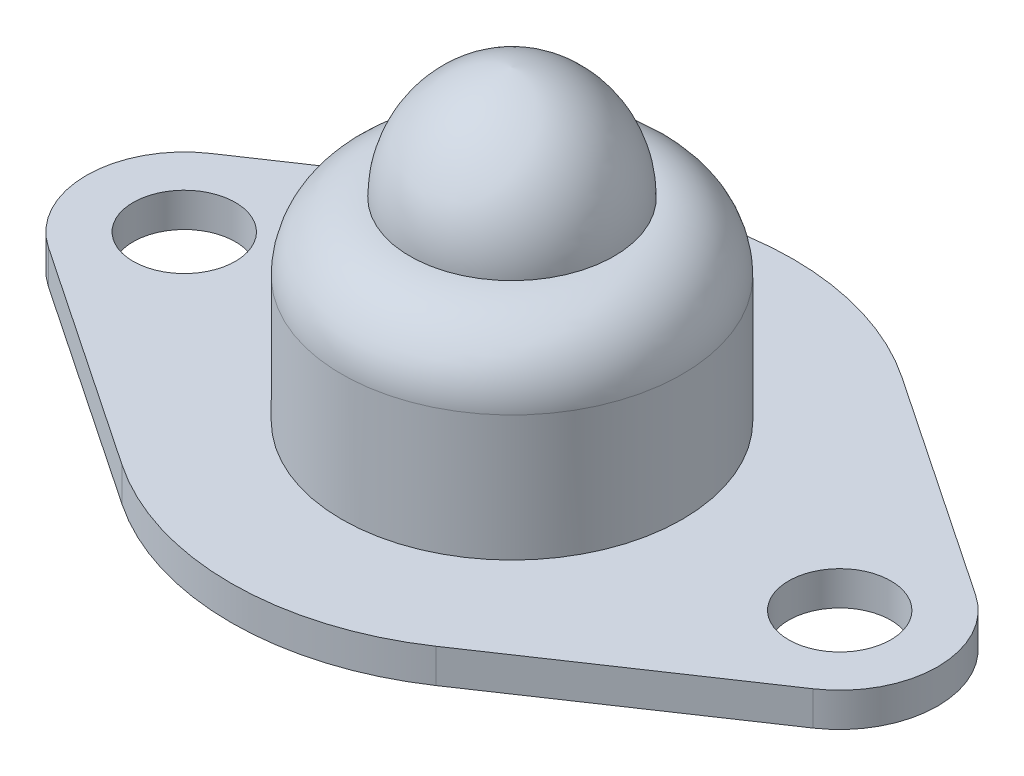
ISO-10303-21;
HEADER;
FILE_DESCRIPTION(('STEP AP214'),'2;1');
FILE_NAME('part.step','',(''),(''),'','','');
FILE_SCHEMA(('AUTOMOTIVE_DESIGN { 1 0 10303 214 1 1 1 1 }'));
ENDSEC;
DATA;
#1=APPLICATION_CONTEXT('core data for automotive mechanical design processes');
#2=APPLICATION_PROTOCOL_DEFINITION('international standard','automotive_design',2000,#1);
#3=PRODUCT_CONTEXT('',#1,'mechanical');
#4=PRODUCT('Part','Part','',(#3));
#5=PRODUCT_RELATED_PRODUCT_CATEGORY('part','',(#4));
#6=PRODUCT_DEFINITION_FORMATION('','',#4);
#7=PRODUCT_DEFINITION_CONTEXT('part definition',#1,'design');
#8=PRODUCT_DEFINITION('design','',#6,#7);
#9=PRODUCT_DEFINITION_SHAPE('','',#8);
#10=(LENGTH_UNIT() NAMED_UNIT(*) SI_UNIT(.MILLI.,.METRE.));
#11=(NAMED_UNIT(*) PLANE_ANGLE_UNIT() SI_UNIT($,.RADIAN.));
#12=(NAMED_UNIT(*) SI_UNIT($,.STERADIAN.) SOLID_ANGLE_UNIT());
#13=UNCERTAINTY_MEASURE_WITH_UNIT(LENGTH_MEASURE(1.E-05),#10,'distance_accuracy_value','');
#14=(GEOMETRIC_REPRESENTATION_CONTEXT(3) GLOBAL_UNCERTAINTY_ASSIGNED_CONTEXT((#13)) GLOBAL_UNIT_ASSIGNED_CONTEXT((#10,
#11,#12)) REPRESENTATION_CONTEXT('',''));
#15=CARTESIAN_POINT('',(0.,0.,0.));
#16=DIRECTION('',(0.,0.,1.));
#17=DIRECTION('',(1.,0.,0.));
#18=AXIS2_PLACEMENT_3D('',#15,#16,#17);
#19=CARTESIAN_POINT('',(0.,1.,0.));
#20=DIRECTION('',(0.,1.,0.));
#21=DIRECTION('',(0.,0.,1.));
#22=AXIS2_PLACEMENT_3D('',#19,#20,#21);
#23=PLANE('',#22);
#24=CARTESIAN_POINT('',(0.,1.,0.));
#25=DIRECTION('',(0.,1.,0.));
#26=DIRECTION('',(0.,0.,1.));
#27=AXIS2_PLACEMENT_3D('',#24,#25,#26);
#28=CIRCLE('',#27,5.);
#29=CARTESIAN_POINT('',(0.,1.,5.));
#30=VERTEX_POINT('',#29);
#31=EDGE_CURVE('E11',#30,#30,#28,.T.);
#32=ORIENTED_EDGE('',*,*,#31,.F.);
#33=EDGE_LOOP('',(#32));
#34=FACE_BOUND('',#33,.T.);
#35=CARTESIAN_POINT('',(-9.625,1.,0.));
#36=DIRECTION('',(0.,1.,0.));
#37=DIRECTION('',(0.,0.,1.));
#38=AXIS2_PLACEMENT_3D('',#35,#36,#37);
#39=CIRCLE('',#38,1.5);
#40=CARTESIAN_POINT('',(-9.625,1.,1.5));
#41=VERTEX_POINT('',#40);
#42=EDGE_CURVE('E138',#41,#41,#39,.T.);
#43=ORIENTED_EDGE('',*,*,#42,.F.);
#44=EDGE_LOOP('',(#43));
#45=FACE_BOUND('',#44,.T.);
#46=CARTESIAN_POINT('',(0.,1.,0.));
#47=DIRECTION('',(0.,1.,0.));
#48=DIRECTION('',(0.,0.,1.));
#49=AXIS2_PLACEMENT_3D('',#46,#47,#48);
#50=CIRCLE('',#49,8.25);
#51=CARTESIAN_POINT('',(4.60714285714285,1.,-6.84373689543056));
#52=VERTEX_POINT('',#51);
#53=CARTESIAN_POINT('',(-4.60714285714285,1.,-6.84373689543056));
#54=VERTEX_POINT('',#53);
#55=EDGE_CURVE('E149',#52,#54,#50,.T.);
#56=ORIENTED_EDGE('',*,*,#55,.T.);
#57=DIRECTION('',(-0.829543866112796,0.,0.558441558441558));
#58=VECTOR('',#57,1.);
#59=CARTESIAN_POINT('',(-4.60714285714285,1.,-6.84373689543056));
#60=LINE('',#59,#58);
#61=CARTESIAN_POINT('',(-11.2305194805195,1.,-2.38493861507429));
#62=VERTEX_POINT('',#61);
#63=EDGE_CURVE('E96',#54,#62,#60,.T.);
#64=ORIENTED_EDGE('',*,*,#63,.T.);
#65=CARTESIAN_POINT('',(-9.625,1.,0.));
#66=DIRECTION('',(0.,1.,0.));
#67=DIRECTION('',(0.,0.,1.));
#68=AXIS2_PLACEMENT_3D('',#65,#66,#67);
#69=CIRCLE('',#68,2.87500000000001);
#70=CARTESIAN_POINT('',(-11.2305194805195,1.,2.38493861507429));
#71=VERTEX_POINT('',#70);
#72=EDGE_CURVE('E181',#62,#71,#69,.T.);
#73=ORIENTED_EDGE('',*,*,#72,.T.);
#74=DIRECTION('',(0.829543866112796,0.,0.558441558441558));
#75=VECTOR('',#74,1.);
#76=CARTESIAN_POINT('',(-11.2305194805195,1.,2.38493861507429));
#77=LINE('',#76,#75);
#78=CARTESIAN_POINT('',(-4.60714285714285,1.,6.84373689543056));
#79=VERTEX_POINT('',#78);
#80=EDGE_CURVE('E180',#71,#79,#77,.T.);
#81=ORIENTED_EDGE('',*,*,#80,.T.);
#82=CARTESIAN_POINT('',(0.,1.,0.));
#83=DIRECTION('',(0.,1.,0.));
#84=DIRECTION('',(0.,0.,1.));
#85=AXIS2_PLACEMENT_3D('',#82,#83,#84);
#86=CIRCLE('',#85,8.25);
#87=CARTESIAN_POINT('',(4.60714285714285,1.,6.84373689543057));
#88=VERTEX_POINT('',#87);
#89=EDGE_CURVE('E116',#79,#88,#86,.T.);
#90=ORIENTED_EDGE('',*,*,#89,.T.);
#91=DIRECTION('',(0.829543866112796,0.,-0.558441558441558));
#92=VECTOR('',#91,1.);
#93=CARTESIAN_POINT('',(4.60714285714285,1.,6.84373689543056));
#94=LINE('',#93,#92);
#95=CARTESIAN_POINT('',(11.2305194805195,1.,2.38493861507429));
#96=VERTEX_POINT('',#95);
#97=EDGE_CURVE('E110',#88,#96,#94,.T.);
#98=ORIENTED_EDGE('',*,*,#97,.T.);
#99=CARTESIAN_POINT('',(9.625,1.,0.));
#100=DIRECTION('',(0.,1.,0.));
#101=DIRECTION('',(0.,0.,-1.));
#102=AXIS2_PLACEMENT_3D('',#99,#100,#101);
#103=CIRCLE('',#102,2.87500000000001);
#104=CARTESIAN_POINT('',(11.2305194805195,1.,-2.38493861507429));
#105=VERTEX_POINT('',#104);
#106=EDGE_CURVE('E114',#96,#105,#103,.T.);
#107=ORIENTED_EDGE('',*,*,#106,.T.);
#108=DIRECTION('',(-0.829543866112796,0.,-0.558441558441558));
#109=VECTOR('',#108,1.);
#110=CARTESIAN_POINT('',(11.2305194805195,1.,-2.38493861507429));
#111=LINE('',#110,#109);
#112=EDGE_CURVE('E51',#105,#52,#111,.T.);
#113=ORIENTED_EDGE('',*,*,#112,.T.);
#114=EDGE_LOOP('',(#56,#64,#73,#81,#90,#98,#107,#113));
#115=FACE_BOUND('',#114,.T.);
#116=CARTESIAN_POINT('',(9.625,1.,0.));
#117=DIRECTION('',(0.,1.,0.));
#118=DIRECTION('',(0.,0.,1.));
#119=AXIS2_PLACEMENT_3D('',#116,#117,#118);
#120=CIRCLE('',#119,1.5);
#121=CARTESIAN_POINT('',(9.625,1.,1.5));
#122=VERTEX_POINT('',#121);
#123=EDGE_CURVE('E190',#122,#122,#120,.T.);
#124=ORIENTED_EDGE('',*,*,#123,.F.);
#125=EDGE_LOOP('',(#124));
#126=FACE_BOUND('',#125,.T.);
#127=ADVANCED_FACE('F34',(#34,#45,#115,#126),#23,.T.);
#128=CARTESIAN_POINT('',(0.,0.,0.));
#129=DIRECTION('',(0.,1.,0.));
#130=DIRECTION('',(0.,0.,1.));
#131=AXIS2_PLACEMENT_3D('',#128,#129,#130);
#132=PLANE('',#131);
#133=CARTESIAN_POINT('',(0.,0.,0.));
#134=DIRECTION('',(0.,1.,0.));
#135=DIRECTION('',(0.,0.,1.));
#136=AXIS2_PLACEMENT_3D('',#133,#134,#135);
#137=CIRCLE('',#136,8.25);
#138=CARTESIAN_POINT('',(4.60714285714285,0.,-6.84373689543056));
#139=VERTEX_POINT('',#138);
#140=CARTESIAN_POINT('',(-4.60714285714285,0.,-6.84373689543056));
#141=VERTEX_POINT('',#140);
#142=EDGE_CURVE('E134',#139,#141,#137,.T.);
#143=ORIENTED_EDGE('',*,*,#142,.F.);
#144=DIRECTION('',(-0.829543866112796,0.,-0.558441558441558));
#145=VECTOR('',#144,1.);
#146=CARTESIAN_POINT('',(11.2305194805195,0.,-2.38493861507429));
#147=LINE('',#146,#145);
#148=CARTESIAN_POINT('',(11.2305194805195,0.,-2.38493861507429));
#149=VERTEX_POINT('',#148);
#150=EDGE_CURVE('E87',#149,#139,#147,.T.);
#151=ORIENTED_EDGE('',*,*,#150,.F.);
#152=CARTESIAN_POINT('',(9.625,0.,0.));
#153=DIRECTION('',(0.,1.,0.));
#154=DIRECTION('',(0.,0.,-1.));
#155=AXIS2_PLACEMENT_3D('',#152,#153,#154);
#156=CIRCLE('',#155,2.87500000000001);
#157=CARTESIAN_POINT('',(11.2305194805195,0.,2.38493861507429));
#158=VERTEX_POINT('',#157);
#159=EDGE_CURVE('E81',#158,#149,#156,.T.);
#160=ORIENTED_EDGE('',*,*,#159,.F.);
#161=DIRECTION('',(0.829543866112796,0.,-0.558441558441558));
#162=VECTOR('',#161,1.);
#163=CARTESIAN_POINT('',(4.60714285714285,0.,6.84373689543056));
#164=LINE('',#163,#162);
#165=CARTESIAN_POINT('',(4.60714285714285,0.,6.84373689543057));
#166=VERTEX_POINT('',#165);
#167=EDGE_CURVE('E124',#166,#158,#164,.T.);
#168=ORIENTED_EDGE('',*,*,#167,.F.);
#169=CARTESIAN_POINT('',(0.,0.,0.));
#170=DIRECTION('',(0.,1.,0.));
#171=DIRECTION('',(0.,0.,1.));
#172=AXIS2_PLACEMENT_3D('',#169,#170,#171);
#173=CIRCLE('',#172,8.25);
#174=CARTESIAN_POINT('',(-4.60714285714285,0.,6.84373689543056));
#175=VERTEX_POINT('',#174);
#176=EDGE_CURVE('E144',#175,#166,#173,.T.);
#177=ORIENTED_EDGE('',*,*,#176,.F.);
#178=DIRECTION('',(0.829543866112796,0.,0.558441558441558));
#179=VECTOR('',#178,1.);
#180=CARTESIAN_POINT('',(-11.2305194805195,0.,2.38493861507429));
#181=LINE('',#180,#179);
#182=CARTESIAN_POINT('',(-11.2305194805195,0.,2.38493861507429));
#183=VERTEX_POINT('',#182);
#184=EDGE_CURVE('E142',#183,#175,#181,.T.);
#185=ORIENTED_EDGE('',*,*,#184,.F.);
#186=CARTESIAN_POINT('',(-9.625,0.,0.));
#187=DIRECTION('',(0.,1.,0.));
#188=DIRECTION('',(0.,0.,1.));
#189=AXIS2_PLACEMENT_3D('',#186,#187,#188);
#190=CIRCLE('',#189,2.87500000000001);
#191=CARTESIAN_POINT('',(-11.2305194805195,0.,-2.38493861507429));
#192=VERTEX_POINT('',#191);
#193=EDGE_CURVE('E140',#192,#183,#190,.T.);
#194=ORIENTED_EDGE('',*,*,#193,.F.);
#195=DIRECTION('',(-0.829543866112796,0.,0.558441558441558));
#196=VECTOR('',#195,1.);
#197=CARTESIAN_POINT('',(-4.60714285714285,0.,-6.84373689543056));
#198=LINE('',#197,#196);
#199=EDGE_CURVE('E137',#141,#192,#198,.T.);
#200=ORIENTED_EDGE('',*,*,#199,.F.);
#201=EDGE_LOOP('',(#143,#151,#160,#168,#177,#185,#194,#200));
#202=FACE_BOUND('',#201,.T.);
#203=CARTESIAN_POINT('',(-9.625,0.,0.));
#204=DIRECTION('',(0.,1.,0.));
#205=DIRECTION('',(0.,0.,1.));
#206=AXIS2_PLACEMENT_3D('',#203,#204,#205);
#207=CIRCLE('',#206,1.5);
#208=CARTESIAN_POINT('',(-9.625,0.,1.5));
#209=VERTEX_POINT('',#208);
#210=EDGE_CURVE('E187',#209,#209,#207,.T.);
#211=ORIENTED_EDGE('',*,*,#210,.T.);
#212=EDGE_LOOP('',(#211));
#213=FACE_BOUND('',#212,.T.);
#214=CARTESIAN_POINT('',(9.625,0.,0.));
#215=DIRECTION('',(0.,1.,0.));
#216=DIRECTION('',(0.,0.,1.));
#217=AXIS2_PLACEMENT_3D('',#214,#215,#216);
#218=CIRCLE('',#217,1.5);
#219=CARTESIAN_POINT('',(9.625,0.,1.5));
#220=VERTEX_POINT('',#219);
#221=EDGE_CURVE('E193',#220,#220,#218,.T.);
#222=ORIENTED_EDGE('',*,*,#221,.T.);
#223=EDGE_LOOP('',(#222));
#224=FACE_BOUND('',#223,.T.);
#225=ADVANCED_FACE('F167',(#202,#213,#224),#132,.F.);
#226=CARTESIAN_POINT('',(0.,1.,0.));
#227=DIRECTION('',(0.,-1.,0.));
#228=DIRECTION('',(0.,0.,-1.));
#229=AXIS2_PLACEMENT_3D('',#226,#227,#228);
#230=CYLINDRICAL_SURFACE('',#229,8.25);
#231=ORIENTED_EDGE('',*,*,#142,.T.);
#232=DIRECTION('',(0.,-1.,0.));
#233=VECTOR('',#232,1.);
#234=CARTESIAN_POINT('',(-4.60714285714285,1.,-6.84373689543056));
#235=LINE('',#234,#233);
#236=EDGE_CURVE('E43',#54,#141,#235,.T.);
#237=ORIENTED_EDGE('',*,*,#236,.F.);
#238=ORIENTED_EDGE('',*,*,#55,.F.);
#239=DIRECTION('',(0.,-1.,0.));
#240=VECTOR('',#239,1.);
#241=CARTESIAN_POINT('',(4.60714285714285,1.,-6.84373689543056));
#242=LINE('',#241,#240);
#243=EDGE_CURVE('E130',#52,#139,#242,.T.);
#244=ORIENTED_EDGE('',*,*,#243,.T.);
#245=EDGE_LOOP('',(#231,#237,#238,#244));
#246=FACE_BOUND('',#245,.T.);
#247=ADVANCED_FACE('F36',(#246),#230,.T.);
#248=CARTESIAN_POINT('',(-4.60714285714285,1.,-6.84373689543056));
#249=DIRECTION('',(0.558441558441558,0.,0.829543866112796));
#250=DIRECTION('',(0.829543866112796,0.,-0.558441558441558));
#251=AXIS2_PLACEMENT_3D('',#248,#249,#250);
#252=PLANE('',#251);
#253=ORIENTED_EDGE('',*,*,#199,.T.);
#254=DIRECTION('',(0.,-1.,0.));
#255=VECTOR('',#254,1.);
#256=CARTESIAN_POINT('',(-11.2305194805195,1.,-2.38493861507429));
#257=LINE('',#256,#255);
#258=EDGE_CURVE('E159',#62,#192,#257,.T.);
#259=ORIENTED_EDGE('',*,*,#258,.F.);
#260=ORIENTED_EDGE('',*,*,#63,.F.);
#261=ORIENTED_EDGE('',*,*,#236,.T.);
#262=EDGE_LOOP('',(#253,#259,#260,#261));
#263=FACE_BOUND('',#262,.T.);
#264=ADVANCED_FACE('F162',(#263),#252,.F.);
#265=CARTESIAN_POINT('',(-9.625,1.,0.));
#266=DIRECTION('',(0.,-1.,0.));
#267=DIRECTION('',(0.,0.,-1.));
#268=AXIS2_PLACEMENT_3D('',#265,#266,#267);
#269=CYLINDRICAL_SURFACE('',#268,2.87500000000001);
#270=ORIENTED_EDGE('',*,*,#193,.T.);
#271=DIRECTION('',(0.,-1.,0.));
#272=VECTOR('',#271,1.);
#273=CARTESIAN_POINT('',(-11.2305194805195,1.,2.38493861507429));
#274=LINE('',#273,#272);
#275=EDGE_CURVE('E156',#71,#183,#274,.T.);
#276=ORIENTED_EDGE('',*,*,#275,.F.);
#277=ORIENTED_EDGE('',*,*,#72,.F.);
#278=ORIENTED_EDGE('',*,*,#258,.T.);
#279=EDGE_LOOP('',(#270,#276,#277,#278));
#280=FACE_BOUND('',#279,.T.);
#281=ADVANCED_FACE('F174',(#280),#269,.T.);
#282=CARTESIAN_POINT('',(-11.2305194805195,1.,2.38493861507429));
#283=DIRECTION('',(0.558441558441558,0.,-0.829543866112796));
#284=DIRECTION('',(-0.829543866112796,0.,-0.558441558441558));
#285=AXIS2_PLACEMENT_3D('',#282,#283,#284);
#286=PLANE('',#285);
#287=ORIENTED_EDGE('',*,*,#184,.T.);
#288=DIRECTION('',(0.,-1.,0.));
#289=VECTOR('',#288,1.);
#290=CARTESIAN_POINT('',(-4.60714285714285,1.,6.84373689543056));
#291=LINE('',#290,#289);
#292=EDGE_CURVE('E153',#79,#175,#291,.T.);
#293=ORIENTED_EDGE('',*,*,#292,.F.);
#294=ORIENTED_EDGE('',*,*,#80,.F.);
#295=ORIENTED_EDGE('',*,*,#275,.T.);
#296=EDGE_LOOP('',(#287,#293,#294,#295));
#297=FACE_BOUND('',#296,.T.);
#298=ADVANCED_FACE('F178',(#297),#286,.F.);
#299=CARTESIAN_POINT('',(0.,1.,0.));
#300=DIRECTION('',(0.,-1.,0.));
#301=DIRECTION('',(0.,0.,-1.));
#302=AXIS2_PLACEMENT_3D('',#299,#300,#301);
#303=CYLINDRICAL_SURFACE('',#302,8.25);
#304=ORIENTED_EDGE('',*,*,#176,.T.);
#305=DIRECTION('',(0.,-1.,0.));
#306=VECTOR('',#305,1.);
#307=CARTESIAN_POINT('',(4.60714285714285,1.,6.84373689543057));
#308=LINE('',#307,#306);
#309=EDGE_CURVE('E125',#88,#166,#308,.T.);
#310=ORIENTED_EDGE('',*,*,#309,.F.);
#311=ORIENTED_EDGE('',*,*,#89,.F.);
#312=ORIENTED_EDGE('',*,*,#292,.T.);
#313=EDGE_LOOP('',(#304,#310,#311,#312));
#314=FACE_BOUND('',#313,.T.);
#315=ADVANCED_FACE('F241',(#314),#303,.T.);
#316=CARTESIAN_POINT('',(4.60714285714285,1.,6.84373689543056));
#317=DIRECTION('',(-0.558441558441558,0.,-0.829543866112796));
#318=DIRECTION('',(-0.829543866112796,0.,0.558441558441558));
#319=AXIS2_PLACEMENT_3D('',#316,#317,#318);
#320=PLANE('',#319);
#321=ORIENTED_EDGE('',*,*,#167,.T.);
#322=DIRECTION('',(0.,-1.,0.));
#323=VECTOR('',#322,1.);
#324=CARTESIAN_POINT('',(11.2305194805195,1.,2.38493861507429));
#325=LINE('',#324,#323);
#326=EDGE_CURVE('E121',#96,#158,#325,.T.);
#327=ORIENTED_EDGE('',*,*,#326,.F.);
#328=ORIENTED_EDGE('',*,*,#97,.F.);
#329=ORIENTED_EDGE('',*,*,#309,.T.);
#330=EDGE_LOOP('',(#321,#327,#328,#329));
#331=FACE_BOUND('',#330,.T.);
#332=ADVANCED_FACE('F122',(#331),#320,.F.);
#333=CARTESIAN_POINT('',(9.625,1.,0.));
#334=DIRECTION('',(0.,-1.,0.));
#335=DIRECTION('',(0.,0.,-1.));
#336=AXIS2_PLACEMENT_3D('',#333,#334,#335);
#337=CYLINDRICAL_SURFACE('',#336,2.87500000000001);
#338=ORIENTED_EDGE('',*,*,#159,.T.);
#339=DIRECTION('',(0.,-1.,0.));
#340=VECTOR('',#339,1.);
#341=CARTESIAN_POINT('',(11.2305194805195,1.,-2.38493861507429));
#342=LINE('',#341,#340);
#343=EDGE_CURVE('E126',#105,#149,#342,.T.);
#344=ORIENTED_EDGE('',*,*,#343,.F.);
#345=ORIENTED_EDGE('',*,*,#106,.F.);
#346=ORIENTED_EDGE('',*,*,#326,.T.);
#347=EDGE_LOOP('',(#338,#344,#345,#346));
#348=FACE_BOUND('',#347,.T.);
#349=ADVANCED_FACE('F128',(#348),#337,.T.);
#350=CARTESIAN_POINT('',(11.2305194805195,1.,-2.38493861507429));
#351=DIRECTION('',(-0.558441558441558,0.,0.829543866112796));
#352=DIRECTION('',(0.829543866112796,0.,0.558441558441558));
#353=AXIS2_PLACEMENT_3D('',#350,#351,#352);
#354=PLANE('',#353);
#355=ORIENTED_EDGE('',*,*,#150,.T.);
#356=ORIENTED_EDGE('',*,*,#243,.F.);
#357=ORIENTED_EDGE('',*,*,#112,.F.);
#358=ORIENTED_EDGE('',*,*,#343,.T.);
#359=EDGE_LOOP('',(#355,#356,#357,#358));
#360=FACE_BOUND('',#359,.T.);
#361=ADVANCED_FACE('F234',(#360),#354,.F.);
#362=CARTESIAN_POINT('',(-9.625,1.,0.));
#363=DIRECTION('',(0.,-1.,0.));
#364=DIRECTION('',(0.,0.,-1.));
#365=AXIS2_PLACEMENT_3D('',#362,#363,#364);
#366=CYLINDRICAL_SURFACE('',#365,1.5);
#367=ORIENTED_EDGE('',*,*,#42,.T.);
#368=EDGE_LOOP('',(#367));
#369=FACE_BOUND('',#368,.T.);
#370=ORIENTED_EDGE('',*,*,#210,.F.);
#371=EDGE_LOOP('',(#370));
#372=FACE_BOUND('',#371,.T.);
#373=ADVANCED_FACE('F231',(#369,#372),#366,.F.);
#374=CARTESIAN_POINT('',(9.625,1.,0.));
#375=DIRECTION('',(0.,-1.,0.));
#376=DIRECTION('',(0.,0.,-1.));
#377=AXIS2_PLACEMENT_3D('',#374,#375,#376);
#378=CYLINDRICAL_SURFACE('',#377,1.5);
#379=ORIENTED_EDGE('',*,*,#123,.T.);
#380=EDGE_LOOP('',(#379));
#381=FACE_BOUND('',#380,.T.);
#382=ORIENTED_EDGE('',*,*,#221,.F.);
#383=EDGE_LOOP('',(#382));
#384=FACE_BOUND('',#383,.T.);
#385=ADVANCED_FACE('F218',(#381,#384),#378,.F.);
#386=CARTESIAN_POINT('',(0.,6.69023162063334,0.329428742876666));
#387=DIRECTION('',(-1.,0.,0.));
#388=DIRECTION('',(0.,0.,-1.));
#389=AXIS2_PLACEMENT_3D('',#386,#387,#388);
#390=CIRCLE('',#389,3.32612237022163);
#391=TRIMMED_CURVE('',#390,(PARAMETER_VALUE(-1.47159079984221)),
(PARAMETER_VALUE(1.47159079984221)),.T.,.PARAMETER.);
#392=CARTESIAN_POINT('',(0.,6.69023162063334,0.));
#393=DIRECTION('',(0.,-1.,0.));
#394=AXIS1_PLACEMENT('',#392,#393);
#395=SURFACE_OF_REVOLUTION('',#391,#394);
#396=CARTESIAN_POINT('',(0.,10.,0.));
#397=VERTEX_POINT('',#396);
#398=VERTEX_LOOP('',#397);
#399=FACE_BOUND('',#398,.T.);
#400=CARTESIAN_POINT('',(0.,6.69023162063334,0.));
#401=DIRECTION('',(0.,-1.,0.));
#402=DIRECTION('',(0.,0.,-1.));
#403=AXIS2_PLACEMENT_3D('',#400,#401,#402);
#404=CIRCLE('',#403,2.99669362734496);
#405=CARTESIAN_POINT('',(0.,6.69023162063334,-2.99669362734496));
#406=VERTEX_POINT('',#405);
#407=EDGE_CURVE('E196',#406,#406,#404,.T.);
#408=ORIENTED_EDGE('',*,*,#407,.F.);
#409=EDGE_LOOP('',(#408));
#410=FACE_BOUND('',#409,.T.);
#411=ADVANCED_FACE('F210',(#399,#410),#395,.T.);
#412=CARTESIAN_POINT('',(0.,4.69023162063334,0.));
#413=DIRECTION('',(0.,-1.,0.));
#414=DIRECTION('',(0.,0.,-1.));
#415=AXIS2_PLACEMENT_3D('',#412,#413,#414);
#416=TOROIDAL_SURFACE('',#415,2.99999727148571,2.00000272851429);
#417=ORIENTED_EDGE('',*,*,#407,.T.);
#418=EDGE_LOOP('',(#417));
#419=FACE_BOUND('',#418,.T.);
#420=CARTESIAN_POINT('',(0.,4.69023162063334,0.));
#421=DIRECTION('',(0.,-1.,0.));
#422=DIRECTION('',(0.,0.,-1.));
#423=AXIS2_PLACEMENT_3D('',#420,#421,#422);
#424=CIRCLE('',#423,5.);
#425=CARTESIAN_POINT('',(0.,4.69023162063334,-5.));
#426=VERTEX_POINT('',#425);
#427=EDGE_CURVE('E201',#426,#426,#424,.T.);
#428=ORIENTED_EDGE('',*,*,#427,.F.);
#429=EDGE_LOOP('',(#428));
#430=FACE_BOUND('',#429,.T.);
#431=ADVANCED_FACE('F208',(#419,#430),#416,.T.);
#432=CARTESIAN_POINT('',(0.,-1.14822113310355,0.));
#433=DIRECTION('',(0.,-1.,0.));
#434=DIRECTION('',(0.,0.,-1.));
#435=AXIS2_PLACEMENT_3D('',#432,#433,#434);
#436=CYLINDRICAL_SURFACE('',#435,5.);
#437=ORIENTED_EDGE('',*,*,#427,.T.);
#438=EDGE_LOOP('',(#437));
#439=FACE_BOUND('',#438,.T.);
#440=ORIENTED_EDGE('',*,*,#31,.T.);
#441=EDGE_LOOP('',(#440));
#442=FACE_BOUND('',#441,.T.);
#443=ADVANCED_FACE('F205',(#439,#442),#436,.T.);
#444=CLOSED_SHELL('',(#127,#225,#247,#264,#281,#298,#315,#332,#349,#361,#373,#385,#411,#431,#443));
#445=MANIFOLD_SOLID_BREP('B2',#444);
#446=ADVANCED_BREP_SHAPE_REPRESENTATION('',(#18,#445),#14);
#447=SHAPE_DEFINITION_REPRESENTATION(#9,#446);
ENDSEC;
END-ISO-10303-21;
